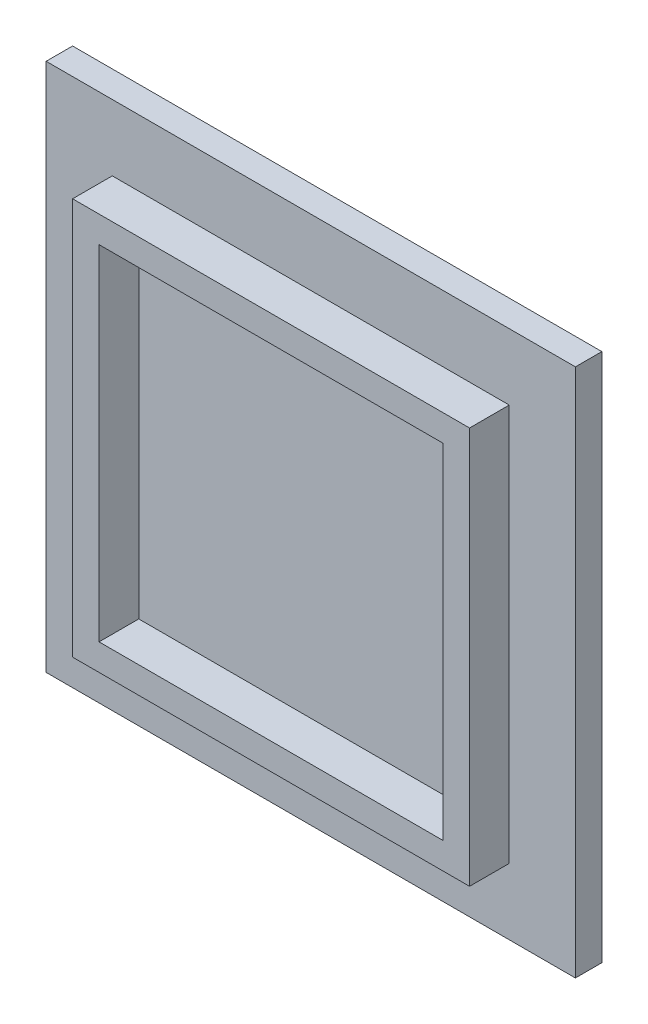
ISO-10303-21;
HEADER;
FILE_DESCRIPTION(('STEP AP214'),'2;1');
FILE_NAME('part.step','',(''),(''),'','','');
FILE_SCHEMA(('AUTOMOTIVE_DESIGN { 1 0 10303 214 1 1 1 1 }'));
ENDSEC;
DATA;
#1=APPLICATION_CONTEXT('core data for automotive mechanical design processes');
#2=APPLICATION_PROTOCOL_DEFINITION('international standard','automotive_design',2000,#1);
#3=PRODUCT_CONTEXT('',#1,'mechanical');
#4=PRODUCT('Part','Part','',(#3));
#5=PRODUCT_RELATED_PRODUCT_CATEGORY('part','',(#4));
#6=PRODUCT_DEFINITION_FORMATION('','',#4);
#7=PRODUCT_DEFINITION_CONTEXT('part definition',#1,'design');
#8=PRODUCT_DEFINITION('design','',#6,#7);
#9=PRODUCT_DEFINITION_SHAPE('','',#8);
#10=(LENGTH_UNIT() NAMED_UNIT(*) SI_UNIT(.MILLI.,.METRE.));
#11=(NAMED_UNIT(*) PLANE_ANGLE_UNIT() SI_UNIT($,.RADIAN.));
#12=(NAMED_UNIT(*) SI_UNIT($,.STERADIAN.) SOLID_ANGLE_UNIT());
#13=UNCERTAINTY_MEASURE_WITH_UNIT(LENGTH_MEASURE(1.E-05),#10,'distance_accuracy_value','');
#14=(GEOMETRIC_REPRESENTATION_CONTEXT(3) GLOBAL_UNCERTAINTY_ASSIGNED_CONTEXT((#13)) GLOBAL_UNIT_ASSIGNED_CONTEXT((#10,
#11,#12)) REPRESENTATION_CONTEXT('',''));
#15=CARTESIAN_POINT('',(0.,0.,0.));
#16=DIRECTION('',(0.,0.,1.));
#17=DIRECTION('',(1.,0.,0.));
#18=AXIS2_PLACEMENT_3D('',#15,#16,#17);
#19=CARTESIAN_POINT('',(0.,0.,2.));
#20=DIRECTION('',(0.,0.,1.));
#21=DIRECTION('',(1.,0.,0.));
#22=AXIS2_PLACEMENT_3D('',#19,#20,#21);
#23=PLANE('',#22);
#24=DIRECTION('',(0.,-1.,0.));
#25=VECTOR('',#24,1.);
#26=CARTESIAN_POINT('',(-25.1923076923077,15.1442307692308,2.));
#27=LINE('',#26,#25);
#28=CARTESIAN_POINT('',(-25.1923076923077,15.1442307692308,2.));
#29=VERTEX_POINT('',#28);
#30=CARTESIAN_POINT('',(-25.1923076923077,-24.8557692307692,2.));
#31=VERTEX_POINT('',#30);
#32=EDGE_CURVE('E196',#29,#31,#27,.T.);
#33=ORIENTED_EDGE('',*,*,#32,.T.);
#34=DIRECTION('',(1.,0.,0.));
#35=VECTOR('',#34,1.);
#36=CARTESIAN_POINT('',(-25.1923076923077,-24.8557692307692,2.));
#37=LINE('',#36,#35);
#38=CARTESIAN_POINT('',(14.8076923076923,-24.8557692307692,2.));
#39=VERTEX_POINT('',#38);
#40=EDGE_CURVE('E199',#31,#39,#37,.T.);
#41=ORIENTED_EDGE('',*,*,#40,.T.);
#42=DIRECTION('',(0.,1.,0.));
#43=VECTOR('',#42,1.);
#44=CARTESIAN_POINT('',(14.8076923076923,15.1442307692308,2.));
#45=LINE('',#44,#43);
#46=CARTESIAN_POINT('',(14.8076923076923,15.1442307692308,2.));
#47=VERTEX_POINT('',#46);
#48=EDGE_CURVE('E202',#39,#47,#45,.T.);
#49=ORIENTED_EDGE('',*,*,#48,.T.);
#50=DIRECTION('',(-1.,0.,0.));
#51=VECTOR('',#50,1.);
#52=CARTESIAN_POINT('',(-25.1923076923077,15.1442307692308,2.));
#53=LINE('',#52,#51);
#54=EDGE_CURVE('E204',#47,#29,#53,.T.);
#55=ORIENTED_EDGE('',*,*,#54,.T.);
#56=EDGE_LOOP('',(#33,#41,#49,#55));
#57=FACE_BOUND('',#56,.T.);
#58=DIRECTION('',(1.,0.,0.));
#59=VECTOR('',#58,1.);
#60=CARTESIAN_POINT('',(9.80769230769232,-19.8557692307691,2.));
#61=LINE('',#60,#59);
#62=CARTESIAN_POINT('',(-20.1923076923077,-19.8557692307691,2.));
#63=VERTEX_POINT('',#62);
#64=CARTESIAN_POINT('',(9.80769230769232,-19.8557692307691,2.));
#65=VERTEX_POINT('',#64);
#66=EDGE_CURVE('E182',#63,#65,#61,.T.);
#67=ORIENTED_EDGE('',*,*,#66,.F.);
#68=DIRECTION('',(0.,-1.,0.));
#69=VECTOR('',#68,1.);
#70=CARTESIAN_POINT('',(-20.1923076923077,-19.8557692307691,2.));
#71=LINE('',#70,#69);
#72=CARTESIAN_POINT('',(-20.1923076923077,10.1442307692307,2.));
#73=VERTEX_POINT('',#72);
#74=EDGE_CURVE('E147',#73,#63,#71,.T.);
#75=ORIENTED_EDGE('',*,*,#74,.F.);
#76=DIRECTION('',(-1.,0.,0.));
#77=VECTOR('',#76,1.);
#78=CARTESIAN_POINT('',(9.80769230769232,10.1442307692307,2.));
#79=LINE('',#78,#77);
#80=CARTESIAN_POINT('',(9.80769230769232,10.1442307692307,2.));
#81=VERTEX_POINT('',#80);
#82=EDGE_CURVE('E173',#81,#73,#79,.T.);
#83=ORIENTED_EDGE('',*,*,#82,.F.);
#84=DIRECTION('',(0.,1.,0.));
#85=VECTOR('',#84,1.);
#86=CARTESIAN_POINT('',(9.80769230769232,-19.8557692307691,2.));
#87=LINE('',#86,#85);
#88=EDGE_CURVE('E184',#65,#81,#87,.T.);
#89=ORIENTED_EDGE('',*,*,#88,.F.);
#90=EDGE_LOOP('',(#67,#75,#83,#89));
#91=FACE_BOUND('',#90,.T.);
#92=ADVANCED_FACE('F39',(#57,#91),#23,.T.);
#93=CARTESIAN_POINT('',(-25.1923076923077,15.1442307692308,2.));
#94=DIRECTION('',(1.,0.,0.));
#95=DIRECTION('',(0.,1.,0.));
#96=AXIS2_PLACEMENT_3D('',#93,#94,#95);
#97=PLANE('',#96);
#98=DIRECTION('',(0.,-1.,0.));
#99=VECTOR('',#98,1.);
#100=CARTESIAN_POINT('',(-25.1923076923077,15.1442307692308,0.));
#101=LINE('',#100,#99);
#102=CARTESIAN_POINT('',(-25.1923076923077,15.1442307692308,0.));
#103=VERTEX_POINT('',#102);
#104=CARTESIAN_POINT('',(-25.1923076923077,-24.8557692307692,0.));
#105=VERTEX_POINT('',#104);
#106=EDGE_CURVE('E195',#103,#105,#101,.T.);
#107=ORIENTED_EDGE('',*,*,#106,.T.);
#108=DIRECTION('',(0.,0.,-1.));
#109=VECTOR('',#108,1.);
#110=CARTESIAN_POINT('',(-25.1923076923077,-24.8557692307692,2.));
#111=LINE('',#110,#109);
#112=EDGE_CURVE('E11',#31,#105,#111,.T.);
#113=ORIENTED_EDGE('',*,*,#112,.F.);
#114=ORIENTED_EDGE('',*,*,#32,.F.);
#115=DIRECTION('',(0.,0.,-1.));
#116=VECTOR('',#115,1.);
#117=CARTESIAN_POINT('',(-25.1923076923077,15.1442307692308,2.));
#118=LINE('',#117,#116);
#119=EDGE_CURVE('E206',#29,#103,#118,.T.);
#120=ORIENTED_EDGE('',*,*,#119,.T.);
#121=EDGE_LOOP('',(#107,#113,#114,#120));
#122=FACE_BOUND('',#121,.T.);
#123=ADVANCED_FACE('F41',(#122),#97,.F.);
#124=CARTESIAN_POINT('',(-25.1923076923077,-24.8557692307692,2.));
#125=DIRECTION('',(0.,1.,0.));
#126=DIRECTION('',(0.,0.,1.));
#127=AXIS2_PLACEMENT_3D('',#124,#125,#126);
#128=PLANE('',#127);
#129=DIRECTION('',(1.,0.,0.));
#130=VECTOR('',#129,1.);
#131=CARTESIAN_POINT('',(-25.1923076923077,-24.8557692307692,0.));
#132=LINE('',#131,#130);
#133=CARTESIAN_POINT('',(14.8076923076923,-24.8557692307692,0.));
#134=VERTEX_POINT('',#133);
#135=EDGE_CURVE('E209',#105,#134,#132,.T.);
#136=ORIENTED_EDGE('',*,*,#135,.T.);
#137=DIRECTION('',(0.,0.,-1.));
#138=VECTOR('',#137,1.);
#139=CARTESIAN_POINT('',(14.8076923076923,-24.8557692307692,2.));
#140=LINE('',#139,#138);
#141=EDGE_CURVE('E47',#39,#134,#140,.T.);
#142=ORIENTED_EDGE('',*,*,#141,.F.);
#143=ORIENTED_EDGE('',*,*,#40,.F.);
#144=ORIENTED_EDGE('',*,*,#112,.T.);
#145=EDGE_LOOP('',(#136,#142,#143,#144));
#146=FACE_BOUND('',#145,.T.);
#147=ADVANCED_FACE('F239',(#146),#128,.F.);
#148=CARTESIAN_POINT('',(14.8076923076923,15.1442307692308,2.));
#149=DIRECTION('',(-1.,0.,0.));
#150=DIRECTION('',(0.,-1.,0.));
#151=AXIS2_PLACEMENT_3D('',#148,#149,#150);
#152=PLANE('',#151);
#153=DIRECTION('',(0.,1.,0.));
#154=VECTOR('',#153,1.);
#155=CARTESIAN_POINT('',(14.8076923076923,15.1442307692308,0.));
#156=LINE('',#155,#154);
#157=CARTESIAN_POINT('',(14.8076923076923,15.1442307692308,0.));
#158=VERTEX_POINT('',#157);
#159=EDGE_CURVE('E211',#134,#158,#156,.T.);
#160=ORIENTED_EDGE('',*,*,#159,.T.);
#161=DIRECTION('',(0.,0.,-1.));
#162=VECTOR('',#161,1.);
#163=CARTESIAN_POINT('',(14.8076923076923,15.1442307692308,2.));
#164=LINE('',#163,#162);
#165=EDGE_CURVE('E216',#47,#158,#164,.T.);
#166=ORIENTED_EDGE('',*,*,#165,.F.);
#167=ORIENTED_EDGE('',*,*,#48,.F.);
#168=ORIENTED_EDGE('',*,*,#141,.T.);
#169=EDGE_LOOP('',(#160,#166,#167,#168));
#170=FACE_BOUND('',#169,.T.);
#171=ADVANCED_FACE('F223',(#170),#152,.F.);
#172=CARTESIAN_POINT('',(-25.1923076923077,15.1442307692308,2.));
#173=DIRECTION('',(0.,-1.,0.));
#174=DIRECTION('',(0.,0.,-1.));
#175=AXIS2_PLACEMENT_3D('',#172,#173,#174);
#176=PLANE('',#175);
#177=DIRECTION('',(-1.,0.,0.));
#178=VECTOR('',#177,1.);
#179=CARTESIAN_POINT('',(-25.1923076923077,15.1442307692308,0.));
#180=LINE('',#179,#178);
#181=EDGE_CURVE('E200',#158,#103,#180,.T.);
#182=ORIENTED_EDGE('',*,*,#181,.T.);
#183=ORIENTED_EDGE('',*,*,#119,.F.);
#184=ORIENTED_EDGE('',*,*,#54,.F.);
#185=ORIENTED_EDGE('',*,*,#165,.T.);
#186=EDGE_LOOP('',(#182,#183,#184,#185));
#187=FACE_BOUND('',#186,.T.);
#188=ADVANCED_FACE('F232',(#187),#176,.F.);
#189=CARTESIAN_POINT('',(0.,0.,0.));
#190=DIRECTION('',(0.,0.,1.));
#191=DIRECTION('',(1.,0.,0.));
#192=AXIS2_PLACEMENT_3D('',#189,#190,#191);
#193=PLANE('',#192);
#194=ORIENTED_EDGE('',*,*,#106,.F.);
#195=ORIENTED_EDGE('',*,*,#181,.F.);
#196=ORIENTED_EDGE('',*,*,#159,.F.);
#197=ORIENTED_EDGE('',*,*,#135,.F.);
#198=EDGE_LOOP('',(#194,#195,#196,#197));
#199=FACE_BOUND('',#198,.T.);
#200=ADVANCED_FACE('F229',(#199),#193,.F.);
#201=CARTESIAN_POINT('',(0.,0.,5.));
#202=DIRECTION('',(0.,0.,1.));
#203=DIRECTION('',(1.,0.,0.));
#204=AXIS2_PLACEMENT_3D('',#201,#202,#203);
#205=PLANE('',#204);
#206=DIRECTION('',(0.,-1.,0.));
#207=VECTOR('',#206,1.);
#208=CARTESIAN_POINT('',(-20.1923076923077,-19.8557692307691,5.));
#209=LINE('',#208,#207);
#210=CARTESIAN_POINT('',(-20.1923076923077,10.1442307692307,5.));
#211=VERTEX_POINT('',#210);
#212=CARTESIAN_POINT('',(-20.1923076923077,-19.8557692307691,5.));
#213=VERTEX_POINT('',#212);
#214=EDGE_CURVE('E169',#211,#213,#209,.T.);
#215=ORIENTED_EDGE('',*,*,#214,.T.);
#216=DIRECTION('',(1.,0.,0.));
#217=VECTOR('',#216,1.);
#218=CARTESIAN_POINT('',(9.80769230769232,-19.8557692307691,5.));
#219=LINE('',#218,#217);
#220=CARTESIAN_POINT('',(9.80769230769232,-19.8557692307691,5.));
#221=VERTEX_POINT('',#220);
#222=EDGE_CURVE('E172',#213,#221,#219,.T.);
#223=ORIENTED_EDGE('',*,*,#222,.T.);
#224=DIRECTION('',(0.,1.,0.));
#225=VECTOR('',#224,1.);
#226=CARTESIAN_POINT('',(9.80769230769232,-19.8557692307691,5.));
#227=LINE('',#226,#225);
#228=CARTESIAN_POINT('',(9.80769230769232,10.1442307692307,5.));
#229=VERTEX_POINT('',#228);
#230=EDGE_CURVE('E175',#221,#229,#227,.T.);
#231=ORIENTED_EDGE('',*,*,#230,.T.);
#232=DIRECTION('',(-1.,0.,0.));
#233=VECTOR('',#232,1.);
#234=CARTESIAN_POINT('',(9.80769230769232,10.1442307692307,5.));
#235=LINE('',#234,#233);
#236=EDGE_CURVE('E177',#229,#211,#235,.T.);
#237=ORIENTED_EDGE('',*,*,#236,.T.);
#238=EDGE_LOOP('',(#215,#223,#231,#237));
#239=FACE_BOUND('',#238,.T.);
#240=DIRECTION('',(1.,0.,0.));
#241=VECTOR('',#240,1.);
#242=CARTESIAN_POINT('',(7.8076923076923,-17.8557692307692,5.));
#243=LINE('',#242,#241);
#244=CARTESIAN_POINT('',(-18.1923076923077,-17.8557692307692,5.));
#245=VERTEX_POINT('',#244);
#246=CARTESIAN_POINT('',(7.8076923076923,-17.8557692307692,5.));
#247=VERTEX_POINT('',#246);
#248=EDGE_CURVE('E139',#245,#247,#243,.T.);
#249=ORIENTED_EDGE('',*,*,#248,.F.);
#250=DIRECTION('',(0.,-1.,0.));
#251=VECTOR('',#250,1.);
#252=CARTESIAN_POINT('',(-18.1923076923077,-17.8557692307692,5.));
#253=LINE('',#252,#251);
#254=CARTESIAN_POINT('',(-18.1923076923077,8.14423076923077,5.));
#255=VERTEX_POINT('',#254);
#256=EDGE_CURVE('E130',#255,#245,#253,.T.);
#257=ORIENTED_EDGE('',*,*,#256,.F.);
#258=DIRECTION('',(-1.,0.,0.));
#259=VECTOR('',#258,1.);
#260=CARTESIAN_POINT('',(7.8076923076923,8.14423076923077,5.));
#261=LINE('',#260,#259);
#262=CARTESIAN_POINT('',(7.8076923076923,8.14423076923077,5.));
#263=VERTEX_POINT('',#262);
#264=EDGE_CURVE('E155',#263,#255,#261,.T.);
#265=ORIENTED_EDGE('',*,*,#264,.F.);
#266=DIRECTION('',(0.,1.,0.));
#267=VECTOR('',#266,1.);
#268=CARTESIAN_POINT('',(7.8076923076923,-17.8557692307692,5.));
#269=LINE('',#268,#267);
#270=EDGE_CURVE('E153',#247,#263,#269,.T.);
#271=ORIENTED_EDGE('',*,*,#270,.F.);
#272=EDGE_LOOP('',(#249,#257,#265,#271));
#273=FACE_BOUND('',#272,.T.);
#274=ADVANCED_FACE('F151',(#239,#273),#205,.T.);
#275=CARTESIAN_POINT('',(-20.1923076923077,-19.8557692307691,5.));
#276=DIRECTION('',(1.,0.,0.));
#277=DIRECTION('',(0.,1.,0.));
#278=AXIS2_PLACEMENT_3D('',#275,#276,#277);
#279=PLANE('',#278);
#280=ORIENTED_EDGE('',*,*,#74,.T.);
#281=DIRECTION('',(0.,0.,-1.));
#282=VECTOR('',#281,1.);
#283=CARTESIAN_POINT('',(-20.1923076923077,-19.8557692307691,5.));
#284=LINE('',#283,#282);
#285=EDGE_CURVE('E193',#213,#63,#284,.T.);
#286=ORIENTED_EDGE('',*,*,#285,.F.);
#287=ORIENTED_EDGE('',*,*,#214,.F.);
#288=DIRECTION('',(0.,0.,-1.));
#289=VECTOR('',#288,1.);
#290=CARTESIAN_POINT('',(-20.1923076923077,10.1442307692307,5.));
#291=LINE('',#290,#289);
#292=EDGE_CURVE('E179',#211,#73,#291,.T.);
#293=ORIENTED_EDGE('',*,*,#292,.T.);
#294=EDGE_LOOP('',(#280,#286,#287,#293));
#295=FACE_BOUND('',#294,.T.);
#296=ADVANCED_FACE('F277',(#295),#279,.F.);
#297=CARTESIAN_POINT('',(9.80769230769232,-19.8557692307691,5.));
#298=DIRECTION('',(0.,1.,0.));
#299=DIRECTION('',(-1.,0.,0.));
#300=AXIS2_PLACEMENT_3D('',#297,#298,#299);
#301=PLANE('',#300);
#302=ORIENTED_EDGE('',*,*,#66,.T.);
#303=DIRECTION('',(0.,0.,-1.));
#304=VECTOR('',#303,1.);
#305=CARTESIAN_POINT('',(9.80769230769232,-19.8557692307691,5.));
#306=LINE('',#305,#304);
#307=EDGE_CURVE('E190',#221,#65,#306,.T.);
#308=ORIENTED_EDGE('',*,*,#307,.F.);
#309=ORIENTED_EDGE('',*,*,#222,.F.);
#310=ORIENTED_EDGE('',*,*,#285,.T.);
#311=EDGE_LOOP('',(#302,#308,#309,#310));
#312=FACE_BOUND('',#311,.T.);
#313=ADVANCED_FACE('F284',(#312),#301,.F.);
#314=CARTESIAN_POINT('',(9.80769230769232,-19.8557692307691,5.));
#315=DIRECTION('',(-1.,0.,0.));
#316=DIRECTION('',(0.,-1.,0.));
#317=AXIS2_PLACEMENT_3D('',#314,#315,#316);
#318=PLANE('',#317);
#319=ORIENTED_EDGE('',*,*,#88,.T.);
#320=DIRECTION('',(0.,0.,-1.));
#321=VECTOR('',#320,1.);
#322=CARTESIAN_POINT('',(9.80769230769232,10.1442307692307,5.));
#323=LINE('',#322,#321);
#324=EDGE_CURVE('E54',#229,#81,#323,.T.);
#325=ORIENTED_EDGE('',*,*,#324,.F.);
#326=ORIENTED_EDGE('',*,*,#230,.F.);
#327=ORIENTED_EDGE('',*,*,#307,.T.);
#328=EDGE_LOOP('',(#319,#325,#326,#327));
#329=FACE_BOUND('',#328,.T.);
#330=ADVANCED_FACE('F281',(#329),#318,.F.);
#331=CARTESIAN_POINT('',(9.80769230769232,10.1442307692307,5.));
#332=DIRECTION('',(0.,-1.,0.));
#333=DIRECTION('',(1.,0.,0.));
#334=AXIS2_PLACEMENT_3D('',#331,#332,#333);
#335=PLANE('',#334);
#336=ORIENTED_EDGE('',*,*,#82,.T.);
#337=ORIENTED_EDGE('',*,*,#292,.F.);
#338=ORIENTED_EDGE('',*,*,#236,.F.);
#339=ORIENTED_EDGE('',*,*,#324,.T.);
#340=EDGE_LOOP('',(#336,#337,#338,#339));
#341=FACE_BOUND('',#340,.T.);
#342=ADVANCED_FACE('F274',(#341),#335,.F.);
#343=CARTESIAN_POINT('',(-18.1923076923077,-17.8557692307692,5.));
#344=DIRECTION('',(1.,0.,0.));
#345=DIRECTION('',(0.,0.,-1.));
#346=AXIS2_PLACEMENT_3D('',#343,#344,#345);
#347=PLANE('',#346);
#348=DIRECTION('',(0.,-1.,0.));
#349=VECTOR('',#348,1.);
#350=CARTESIAN_POINT('',(-18.1923076923077,-17.8557692307692,2.));
#351=LINE('',#350,#349);
#352=CARTESIAN_POINT('',(-18.1923076923077,8.14423076923077,2.));
#353=VERTEX_POINT('',#352);
#354=CARTESIAN_POINT('',(-18.1923076923077,-17.8557692307692,2.));
#355=VERTEX_POINT('',#354);
#356=EDGE_CURVE('E62',#353,#355,#351,.T.);
#357=ORIENTED_EDGE('',*,*,#356,.F.);
#358=DIRECTION('',(0.,0.,-1.));
#359=VECTOR('',#358,1.);
#360=CARTESIAN_POINT('',(-18.1923076923077,8.14423076923077,5.));
#361=LINE('',#360,#359);
#362=EDGE_CURVE('E135',#255,#353,#361,.T.);
#363=ORIENTED_EDGE('',*,*,#362,.F.);
#364=ORIENTED_EDGE('',*,*,#256,.T.);
#365=DIRECTION('',(0.,0.,-1.));
#366=VECTOR('',#365,1.);
#367=CARTESIAN_POINT('',(-18.1923076923077,-17.8557692307692,5.));
#368=LINE('',#367,#366);
#369=EDGE_CURVE('E133',#245,#355,#368,.T.);
#370=ORIENTED_EDGE('',*,*,#369,.T.);
#371=EDGE_LOOP('',(#357,#363,#364,#370));
#372=FACE_BOUND('',#371,.T.);
#373=ADVANCED_FACE('F132',(#372),#347,.T.);
#374=CARTESIAN_POINT('',(7.8076923076923,-17.8557692307692,5.));
#375=DIRECTION('',(0.,1.,0.));
#376=DIRECTION('',(0.,0.,1.));
#377=AXIS2_PLACEMENT_3D('',#374,#375,#376);
#378=PLANE('',#377);
#379=DIRECTION('',(1.,0.,0.));
#380=VECTOR('',#379,1.);
#381=CARTESIAN_POINT('',(7.8076923076923,-17.8557692307692,2.));
#382=LINE('',#381,#380);
#383=CARTESIAN_POINT('',(7.8076923076923,-17.8557692307692,2.));
#384=VERTEX_POINT('',#383);
#385=EDGE_CURVE('E146',#355,#384,#382,.T.);
#386=ORIENTED_EDGE('',*,*,#385,.F.);
#387=ORIENTED_EDGE('',*,*,#369,.F.);
#388=ORIENTED_EDGE('',*,*,#248,.T.);
#389=DIRECTION('',(0.,0.,-1.));
#390=VECTOR('',#389,1.);
#391=CARTESIAN_POINT('',(7.8076923076923,-17.8557692307692,5.));
#392=LINE('',#391,#390);
#393=EDGE_CURVE('E148',#247,#384,#392,.T.);
#394=ORIENTED_EDGE('',*,*,#393,.T.);
#395=EDGE_LOOP('',(#386,#387,#388,#394));
#396=FACE_BOUND('',#395,.T.);
#397=ADVANCED_FACE('F143',(#396),#378,.T.);
#398=CARTESIAN_POINT('',(7.8076923076923,-17.8557692307692,5.));
#399=DIRECTION('',(-1.,0.,0.));
#400=DIRECTION('',(0.,0.,1.));
#401=AXIS2_PLACEMENT_3D('',#398,#399,#400);
#402=PLANE('',#401);
#403=DIRECTION('',(0.,1.,0.));
#404=VECTOR('',#403,1.);
#405=CARTESIAN_POINT('',(7.8076923076923,-17.8557692307692,2.));
#406=LINE('',#405,#404);
#407=CARTESIAN_POINT('',(7.8076923076923,8.14423076923077,2.));
#408=VERTEX_POINT('',#407);
#409=EDGE_CURVE('E161',#384,#408,#406,.T.);
#410=ORIENTED_EDGE('',*,*,#409,.F.);
#411=ORIENTED_EDGE('',*,*,#393,.F.);
#412=ORIENTED_EDGE('',*,*,#270,.T.);
#413=DIRECTION('',(0.,0.,-1.));
#414=VECTOR('',#413,1.);
#415=CARTESIAN_POINT('',(7.8076923076923,8.14423076923077,5.));
#416=LINE('',#415,#414);
#417=EDGE_CURVE('E165',#263,#408,#416,.T.);
#418=ORIENTED_EDGE('',*,*,#417,.T.);
#419=EDGE_LOOP('',(#410,#411,#412,#418));
#420=FACE_BOUND('',#419,.T.);
#421=ADVANCED_FACE('F261',(#420),#402,.T.);
#422=CARTESIAN_POINT('',(7.8076923076923,8.14423076923077,5.));
#423=DIRECTION('',(0.,-1.,0.));
#424=DIRECTION('',(0.,0.,-1.));
#425=AXIS2_PLACEMENT_3D('',#422,#423,#424);
#426=PLANE('',#425);
#427=DIRECTION('',(-1.,0.,0.));
#428=VECTOR('',#427,1.);
#429=CARTESIAN_POINT('',(7.8076923076923,8.14423076923077,2.));
#430=LINE('',#429,#428);
#431=EDGE_CURVE('E140',#408,#353,#430,.T.);
#432=ORIENTED_EDGE('',*,*,#431,.F.);
#433=ORIENTED_EDGE('',*,*,#417,.F.);
#434=ORIENTED_EDGE('',*,*,#264,.T.);
#435=ORIENTED_EDGE('',*,*,#362,.T.);
#436=EDGE_LOOP('',(#432,#433,#434,#435));
#437=FACE_BOUND('',#436,.T.);
#438=ADVANCED_FACE('F256',(#437),#426,.T.);
#439=ORIENTED_EDGE('',*,*,#356,.T.);
#440=ORIENTED_EDGE('',*,*,#385,.T.);
#441=ORIENTED_EDGE('',*,*,#409,.T.);
#442=ORIENTED_EDGE('',*,*,#431,.T.);
#443=EDGE_LOOP('',(#439,#440,#441,#442));
#444=FACE_BOUND('',#443,.T.);
#445=ADVANCED_FACE('F248',(#444),#23,.T.);
#446=CLOSED_SHELL('',(#92,#123,#147,#171,#188,#200,#274,#296,#313,#330,#342,#373,#397,#421,#438,#445));
#447=MANIFOLD_SOLID_BREP('B2',#446);
#448=ADVANCED_BREP_SHAPE_REPRESENTATION('',(#18,#447),#14);
#449=SHAPE_DEFINITION_REPRESENTATION(#9,#448);
ENDSEC;
END-ISO-10303-21;
